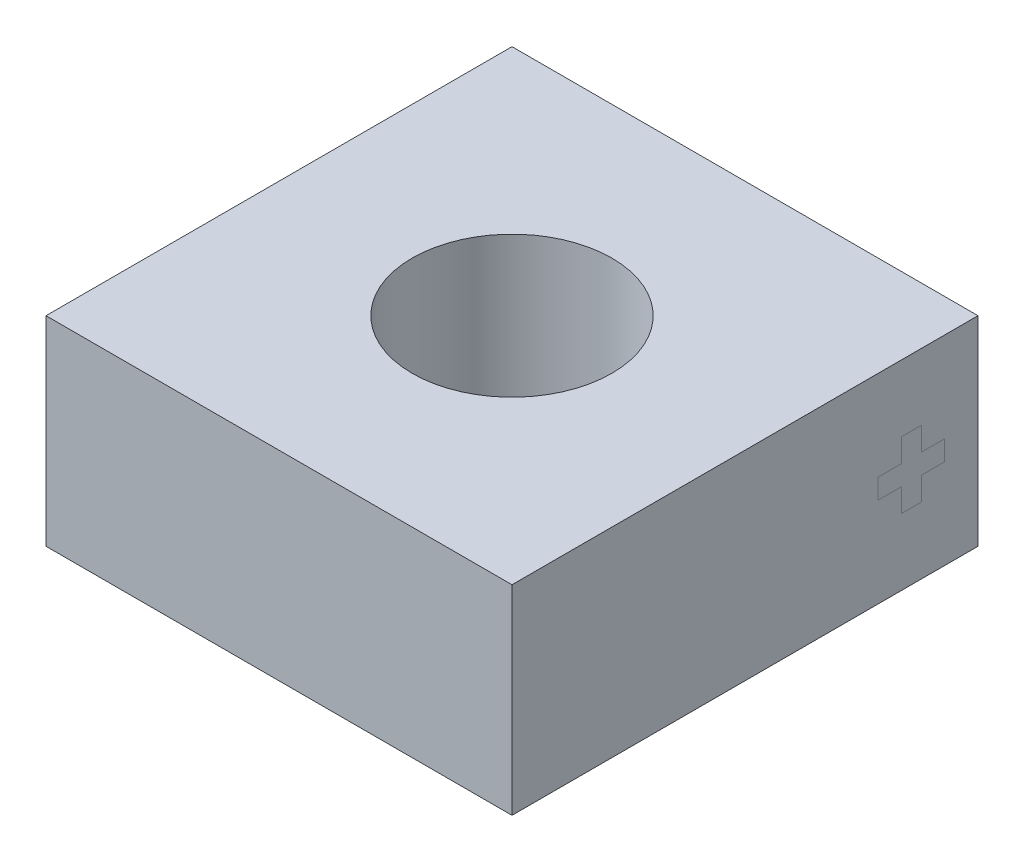
ISO-10303-21;
HEADER;
FILE_DESCRIPTION(('STEP AP214'),'2;1');
FILE_NAME('part.step','',(''),(''),'','','');
FILE_SCHEMA(('AUTOMOTIVE_DESIGN { 1 0 10303 214 1 1 1 1 }'));
ENDSEC;
DATA;
#1=APPLICATION_CONTEXT('core data for automotive mechanical design processes');
#2=APPLICATION_PROTOCOL_DEFINITION('international standard','automotive_design',2000,#1);
#3=PRODUCT_CONTEXT('',#1,'mechanical');
#4=PRODUCT('Part','Part','',(#3));
#5=PRODUCT_RELATED_PRODUCT_CATEGORY('part','',(#4));
#6=PRODUCT_DEFINITION_FORMATION('','',#4);
#7=PRODUCT_DEFINITION_CONTEXT('part definition',#1,'design');
#8=PRODUCT_DEFINITION('design','',#6,#7);
#9=PRODUCT_DEFINITION_SHAPE('','',#8);
#10=(LENGTH_UNIT() NAMED_UNIT(*) SI_UNIT(.MILLI.,.METRE.));
#11=(NAMED_UNIT(*) PLANE_ANGLE_UNIT() SI_UNIT($,.RADIAN.));
#12=(NAMED_UNIT(*) SI_UNIT($,.STERADIAN.) SOLID_ANGLE_UNIT());
#13=UNCERTAINTY_MEASURE_WITH_UNIT(LENGTH_MEASURE(1.E-05),#10,'distance_accuracy_value','');
#14=(GEOMETRIC_REPRESENTATION_CONTEXT(3) GLOBAL_UNCERTAINTY_ASSIGNED_CONTEXT((#13)) GLOBAL_UNIT_ASSIGNED_CONTEXT((#10,
#11,#12)) REPRESENTATION_CONTEXT('',''));
#15=CARTESIAN_POINT('',(0.,0.,0.));
#16=DIRECTION('',(0.,0.,1.));
#17=DIRECTION('',(1.,0.,0.));
#18=AXIS2_PLACEMENT_3D('',#15,#16,#17);
#19=CARTESIAN_POINT('',(3.5,3.,-3.5));
#20=DIRECTION('',(-1.,0.,0.));
#21=DIRECTION('',(0.,0.,1.));
#22=AXIS2_PLACEMENT_3D('',#19,#20,#21);
#23=PLANE('',#22);
#24=DIRECTION('',(0.,1.,0.));
#25=VECTOR('',#24,1.);
#26=CARTESIAN_POINT('',(3.5,1.35,-2.65));
#27=LINE('',#26,#25);
#28=CARTESIAN_POINT('',(3.5,1.,-2.65));
#29=VERTEX_POINT('',#28);
#30=CARTESIAN_POINT('',(3.5,1.35,-2.65));
#31=VERTEX_POINT('',#30);
#32=EDGE_CURVE('E446',#29,#31,#27,.T.);
#33=ORIENTED_EDGE('',*,*,#32,.T.);
#34=DIRECTION('',(0.,0.,-1.));
#35=VECTOR('',#34,1.);
#36=CARTESIAN_POINT('',(3.5,1.35,-2.65));
#37=LINE('',#36,#35);
#38=CARTESIAN_POINT('',(3.5,1.35,-3.));
#39=VERTEX_POINT('',#38);
#40=EDGE_CURVE('E13',#31,#39,#37,.T.);
#41=ORIENTED_EDGE('',*,*,#40,.T.);
#42=DIRECTION('',(0.,1.,0.));
#43=VECTOR('',#42,1.);
#44=CARTESIAN_POINT('',(3.5,1.65,-3.));
#45=LINE('',#44,#43);
#46=CARTESIAN_POINT('',(3.5,1.65,-3.));
#47=VERTEX_POINT('',#46);
#48=EDGE_CURVE('E358',#39,#47,#45,.T.);
#49=ORIENTED_EDGE('',*,*,#48,.T.);
#50=DIRECTION('',(0.,0.,1.));
#51=VECTOR('',#50,1.);
#52=CARTESIAN_POINT('',(3.5,1.65,-2.65));
#53=LINE('',#52,#51);
#54=CARTESIAN_POINT('',(3.5,1.65,-2.65));
#55=VERTEX_POINT('',#54);
#56=EDGE_CURVE('E478',#47,#55,#53,.T.);
#57=ORIENTED_EDGE('',*,*,#56,.T.);
#58=DIRECTION('',(0.,1.,0.));
#59=VECTOR('',#58,1.);
#60=CARTESIAN_POINT('',(3.5,2.,-2.65));
#61=LINE('',#60,#59);
#62=CARTESIAN_POINT('',(3.5,2.,-2.65));
#63=VERTEX_POINT('',#62);
#64=EDGE_CURVE('E475',#55,#63,#61,.T.);
#65=ORIENTED_EDGE('',*,*,#64,.T.);
#66=DIRECTION('',(0.,0.,1.));
#67=VECTOR('',#66,1.);
#68=CARTESIAN_POINT('',(3.5,2.,-2.65));
#69=LINE('',#68,#67);
#70=CARTESIAN_POINT('',(3.5,2.,-2.35));
#71=VERTEX_POINT('',#70);
#72=EDGE_CURVE('E472',#63,#71,#69,.T.);
#73=ORIENTED_EDGE('',*,*,#72,.T.);
#74=DIRECTION('',(0.,-1.,0.));
#75=VECTOR('',#74,1.);
#76=CARTESIAN_POINT('',(3.5,2.,-2.35));
#77=LINE('',#76,#75);
#78=CARTESIAN_POINT('',(3.5,1.65,-2.35));
#79=VERTEX_POINT('',#78);
#80=EDGE_CURVE('E469',#71,#79,#77,.T.);
#81=ORIENTED_EDGE('',*,*,#80,.T.);
#82=DIRECTION('',(0.,0.,1.));
#83=VECTOR('',#82,1.);
#84=CARTESIAN_POINT('',(3.5,1.65,-2.));
#85=LINE('',#84,#83);
#86=CARTESIAN_POINT('',(3.5,1.65,-2.));
#87=VERTEX_POINT('',#86);
#88=EDGE_CURVE('E466',#79,#87,#85,.T.);
#89=ORIENTED_EDGE('',*,*,#88,.T.);
#90=DIRECTION('',(0.,-1.,0.));
#91=VECTOR('',#90,1.);
#92=CARTESIAN_POINT('',(3.5,1.65,-2.));
#93=LINE('',#92,#91);
#94=CARTESIAN_POINT('',(3.5,1.35,-2.));
#95=VERTEX_POINT('',#94);
#96=EDGE_CURVE('E463',#87,#95,#93,.T.);
#97=ORIENTED_EDGE('',*,*,#96,.T.);
#98=DIRECTION('',(0.,0.,-1.));
#99=VECTOR('',#98,1.);
#100=CARTESIAN_POINT('',(3.5,1.35,-2.));
#101=LINE('',#100,#99);
#102=CARTESIAN_POINT('',(3.5,1.35,-2.35));
#103=VERTEX_POINT('',#102);
#104=EDGE_CURVE('E460',#95,#103,#101,.T.);
#105=ORIENTED_EDGE('',*,*,#104,.T.);
#106=DIRECTION('',(0.,-1.,0.));
#107=VECTOR('',#106,1.);
#108=CARTESIAN_POINT('',(3.5,1.35,-2.35));
#109=LINE('',#108,#107);
#110=CARTESIAN_POINT('',(3.5,1.,-2.35));
#111=VERTEX_POINT('',#110);
#112=EDGE_CURVE('E457',#103,#111,#109,.T.);
#113=ORIENTED_EDGE('',*,*,#112,.T.);
#114=DIRECTION('',(0.,0.,-1.));
#115=VECTOR('',#114,1.);
#116=CARTESIAN_POINT('',(3.5,1.,-2.65));
#117=LINE('',#116,#115);
#118=EDGE_CURVE('E449',#111,#29,#117,.T.);
#119=ORIENTED_EDGE('',*,*,#118,.T.);
#120=EDGE_LOOP('',(#33,#41,#49,#57,#65,#73,#81,#89,#97,#105,#113,#119));
#121=FACE_BOUND('',#120,.T.);
#122=ADVANCED_FACE('F348',(#121),#23,.F.);
#123=CARTESIAN_POINT('',(-3.5,3.,-3.5));
#124=DIRECTION('',(1.,0.,0.));
#125=DIRECTION('',(0.,0.,-1.));
#126=AXIS2_PLACEMENT_3D('',#123,#124,#125);
#127=PLANE('',#126);
#128=DIRECTION('',(0.,0.,1.));
#129=VECTOR('',#128,1.);
#130=CARTESIAN_POINT('',(-3.5,0.,-3.5));
#131=LINE('',#130,#129);
#132=CARTESIAN_POINT('',(-3.5,0.,-3.5));
#133=VERTEX_POINT('',#132);
#134=CARTESIAN_POINT('',(-3.5,0.,3.5));
#135=VERTEX_POINT('',#134);
#136=EDGE_CURVE('E445',#133,#135,#131,.T.);
#137=ORIENTED_EDGE('',*,*,#136,.T.);
#138=DIRECTION('',(0.,-1.,0.));
#139=VECTOR('',#138,1.);
#140=CARTESIAN_POINT('',(-3.5,3.,3.5));
#141=LINE('',#140,#139);
#142=CARTESIAN_POINT('',(-3.5,3.,3.5));
#143=VERTEX_POINT('',#142);
#144=EDGE_CURVE('E426',#143,#135,#141,.T.);
#145=ORIENTED_EDGE('',*,*,#144,.F.);
#146=DIRECTION('',(0.,0.,1.));
#147=VECTOR('',#146,1.);
#148=CARTESIAN_POINT('',(-3.5,3.,-3.5));
#149=LINE('',#148,#147);
#150=CARTESIAN_POINT('',(-3.5,3.,-3.5));
#151=VERTEX_POINT('',#150);
#152=EDGE_CURVE('E433',#151,#143,#149,.T.);
#153=ORIENTED_EDGE('',*,*,#152,.F.);
#154=DIRECTION('',(0.,-1.,0.));
#155=VECTOR('',#154,1.);
#156=CARTESIAN_POINT('',(-3.5,3.,-3.5));
#157=LINE('',#156,#155);
#158=EDGE_CURVE('E530',#151,#133,#157,.T.);
#159=ORIENTED_EDGE('',*,*,#158,.T.);
#160=EDGE_LOOP('',(#137,#145,#153,#159));
#161=FACE_BOUND('',#160,.T.);
#162=ADVANCED_FACE('F350',(#161),#127,.F.);
#163=CARTESIAN_POINT('',(-3.5,3.,3.5));
#164=DIRECTION('',(0.,0.,-1.));
#165=DIRECTION('',(-1.,0.,0.));
#166=AXIS2_PLACEMENT_3D('',#163,#164,#165);
#167=PLANE('',#166);
#168=DIRECTION('',(1.,0.,0.));
#169=VECTOR('',#168,1.);
#170=CARTESIAN_POINT('',(-3.5,0.,3.5));
#171=LINE('',#170,#169);
#172=CARTESIAN_POINT('',(3.5,0.,3.5));
#173=VERTEX_POINT('',#172);
#174=EDGE_CURVE('E527',#135,#173,#171,.T.);
#175=ORIENTED_EDGE('',*,*,#174,.T.);
#176=DIRECTION('',(0.,-1.,0.));
#177=VECTOR('',#176,1.);
#178=CARTESIAN_POINT('',(3.5,3.,3.5));
#179=LINE('',#178,#177);
#180=CARTESIAN_POINT('',(3.5,3.,3.5));
#181=VERTEX_POINT('',#180);
#182=EDGE_CURVE('E429',#181,#173,#179,.T.);
#183=ORIENTED_EDGE('',*,*,#182,.F.);
#184=DIRECTION('',(1.,0.,0.));
#185=VECTOR('',#184,1.);
#186=CARTESIAN_POINT('',(-3.5,3.,3.5));
#187=LINE('',#186,#185);
#188=EDGE_CURVE('E422',#143,#181,#187,.T.);
#189=ORIENTED_EDGE('',*,*,#188,.F.);
#190=ORIENTED_EDGE('',*,*,#144,.T.);
#191=EDGE_LOOP('',(#175,#183,#189,#190));
#192=FACE_BOUND('',#191,.T.);
#193=ADVANCED_FACE('F424',(#192),#167,.F.);
#194=ORIENTED_EDGE('',*,*,#40,.F.);
#195=ORIENTED_EDGE('',*,*,#32,.F.);
#196=ORIENTED_EDGE('',*,*,#118,.F.);
#197=ORIENTED_EDGE('',*,*,#112,.F.);
#198=ORIENTED_EDGE('',*,*,#104,.F.);
#199=ORIENTED_EDGE('',*,*,#96,.F.);
#200=ORIENTED_EDGE('',*,*,#88,.F.);
#201=ORIENTED_EDGE('',*,*,#80,.F.);
#202=ORIENTED_EDGE('',*,*,#72,.F.);
#203=ORIENTED_EDGE('',*,*,#64,.F.);
#204=ORIENTED_EDGE('',*,*,#56,.F.);
#205=ORIENTED_EDGE('',*,*,#48,.F.);
#206=EDGE_LOOP('',(#194,#195,#196,#197,#198,#199,#200,#201,#202,#203,#204,#205));
#207=FACE_BOUND('',#206,.T.);
#208=DIRECTION('',(0.,0.,-1.));
#209=VECTOR('',#208,1.);
#210=CARTESIAN_POINT('',(3.5,0.,-3.5));
#211=LINE('',#210,#209);
#212=CARTESIAN_POINT('',(3.5,0.,-3.5));
#213=VERTEX_POINT('',#212);
#214=EDGE_CURVE('E523',#173,#213,#211,.T.);
#215=ORIENTED_EDGE('',*,*,#214,.T.);
#216=DIRECTION('',(0.,-1.,0.));
#217=VECTOR('',#216,1.);
#218=CARTESIAN_POINT('',(3.5,3.,-3.5));
#219=LINE('',#218,#217);
#220=CARTESIAN_POINT('',(3.5,3.,-3.5));
#221=VERTEX_POINT('',#220);
#222=EDGE_CURVE('E451',#221,#213,#219,.T.);
#223=ORIENTED_EDGE('',*,*,#222,.F.);
#224=DIRECTION('',(0.,0.,-1.));
#225=VECTOR('',#224,1.);
#226=CARTESIAN_POINT('',(3.5,3.,-3.5));
#227=LINE('',#226,#225);
#228=EDGE_CURVE('E432',#181,#221,#227,.T.);
#229=ORIENTED_EDGE('',*,*,#228,.F.);
#230=ORIENTED_EDGE('',*,*,#182,.T.);
#231=EDGE_LOOP('',(#215,#223,#229,#230));
#232=FACE_BOUND('',#231,.T.);
#233=ADVANCED_FACE('F509',(#207,#232),#23,.F.);
#234=CARTESIAN_POINT('',(-3.5,3.,-3.5));
#235=DIRECTION('',(0.,0.,1.));
#236=DIRECTION('',(1.,0.,0.));
#237=AXIS2_PLACEMENT_3D('',#234,#235,#236);
#238=PLANE('',#237);
#239=DIRECTION('',(-1.,0.,0.));
#240=VECTOR('',#239,1.);
#241=CARTESIAN_POINT('',(-3.5,0.,-3.5));
#242=LINE('',#241,#240);
#243=EDGE_CURVE('E442',#213,#133,#242,.T.);
#244=ORIENTED_EDGE('',*,*,#243,.T.);
#245=ORIENTED_EDGE('',*,*,#158,.F.);
#246=DIRECTION('',(-1.,0.,0.));
#247=VECTOR('',#246,1.);
#248=CARTESIAN_POINT('',(-3.5,3.,-3.5));
#249=LINE('',#248,#247);
#250=EDGE_CURVE('E438',#221,#151,#249,.T.);
#251=ORIENTED_EDGE('',*,*,#250,.F.);
#252=ORIENTED_EDGE('',*,*,#222,.T.);
#253=EDGE_LOOP('',(#244,#245,#251,#252));
#254=FACE_BOUND('',#253,.T.);
#255=ADVANCED_FACE('F519',(#254),#238,.F.);
#256=CARTESIAN_POINT('',(0.,3.,0.));
#257=DIRECTION('',(0.,1.,0.));
#258=DIRECTION('',(0.,0.,1.));
#259=AXIS2_PLACEMENT_3D('',#256,#257,#258);
#260=PLANE('',#259);
#261=CARTESIAN_POINT('',(0.,3.,0.));
#262=DIRECTION('',(0.,1.,0.));
#263=DIRECTION('',(0.,0.,1.));
#264=AXIS2_PLACEMENT_3D('',#261,#262,#263);
#265=CIRCLE('',#264,1.5);
#266=CARTESIAN_POINT('',(0.,3.,1.5));
#267=VERTEX_POINT('',#266);
#268=EDGE_CURVE('E538',#267,#267,#265,.T.);
#269=ORIENTED_EDGE('',*,*,#268,.F.);
#270=EDGE_LOOP('',(#269));
#271=FACE_BOUND('',#270,.T.);
#272=ORIENTED_EDGE('',*,*,#152,.T.);
#273=ORIENTED_EDGE('',*,*,#188,.T.);
#274=ORIENTED_EDGE('',*,*,#228,.T.);
#275=ORIENTED_EDGE('',*,*,#250,.T.);
#276=EDGE_LOOP('',(#272,#273,#274,#275));
#277=FACE_BOUND('',#276,.T.);
#278=ADVANCED_FACE('F436',(#271,#277),#260,.T.);
#279=CARTESIAN_POINT('',(0.,0.,0.));
#280=DIRECTION('',(0.,1.,0.));
#281=DIRECTION('',(0.,0.,1.));
#282=AXIS2_PLACEMENT_3D('',#279,#280,#281);
#283=PLANE('',#282);
#284=CARTESIAN_POINT('',(0.,0.,0.));
#285=DIRECTION('',(0.,1.,0.));
#286=DIRECTION('',(0.,0.,1.));
#287=AXIS2_PLACEMENT_3D('',#284,#285,#286);
#288=CIRCLE('',#287,1.5);
#289=CARTESIAN_POINT('',(0.,0.,1.5));
#290=VERTEX_POINT('',#289);
#291=EDGE_CURVE('E352',#290,#290,#288,.T.);
#292=ORIENTED_EDGE('',*,*,#291,.T.);
#293=EDGE_LOOP('',(#292));
#294=FACE_BOUND('',#293,.T.);
#295=ORIENTED_EDGE('',*,*,#136,.F.);
#296=ORIENTED_EDGE('',*,*,#243,.F.);
#297=ORIENTED_EDGE('',*,*,#214,.F.);
#298=ORIENTED_EDGE('',*,*,#174,.F.);
#299=EDGE_LOOP('',(#295,#296,#297,#298));
#300=FACE_BOUND('',#299,.T.);
#301=ADVANCED_FACE('F531',(#294,#300),#283,.F.);
#302=CARTESIAN_POINT('',(0.,-6.9999,0.));
#303=DIRECTION('',(0.,1.,0.));
#304=DIRECTION('',(0.,0.,1.));
#305=AXIS2_PLACEMENT_3D('',#302,#303,#304);
#306=CYLINDRICAL_SURFACE('',#305,1.5);
#307=ORIENTED_EDGE('',*,*,#268,.T.);
#308=EDGE_LOOP('',(#307));
#309=FACE_BOUND('',#308,.T.);
#310=ORIENTED_EDGE('',*,*,#291,.F.);
#311=EDGE_LOOP('',(#310));
#312=FACE_BOUND('',#311,.T.);
#313=ADVANCED_FACE('F547',(#309,#312),#306,.F.);
#314=CLOSED_SHELL('',(#122,#162,#193,#233,#255,#278,#301,#313));
#315=MANIFOLD_SOLID_BREP('B2',#314);
#316=ADVANCED_BREP_SHAPE_REPRESENTATION('',(#18,#315),#14);
#317=SHAPE_DEFINITION_REPRESENTATION(#9,#316);
ENDSEC;
END-ISO-10303-21;
